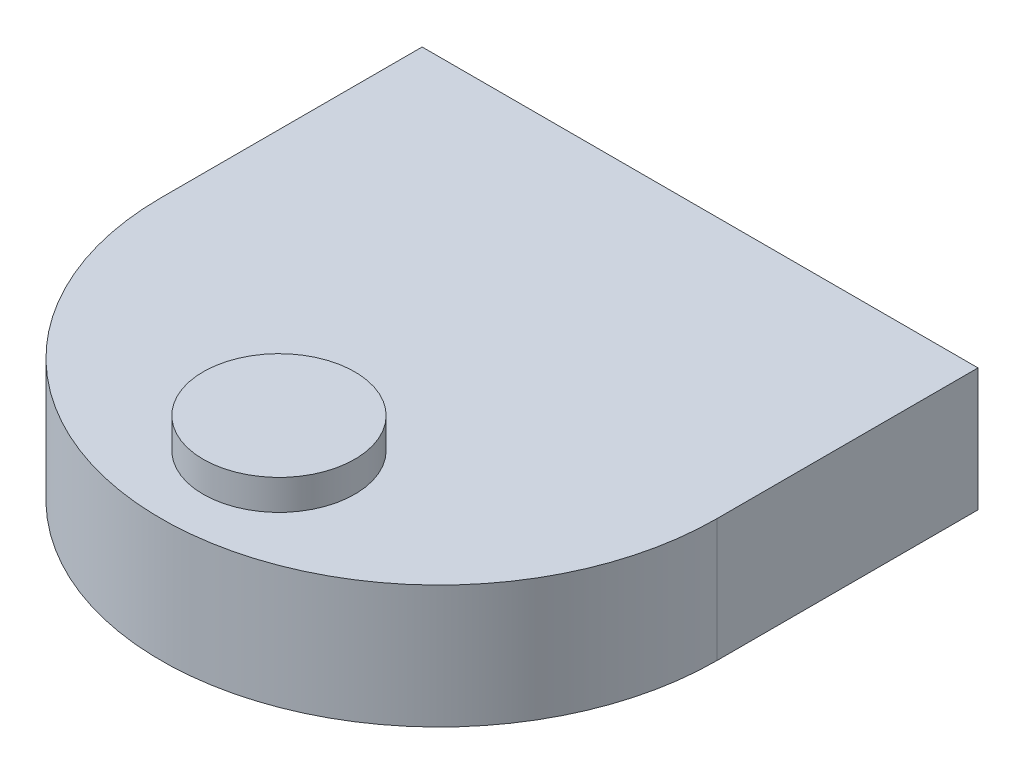
ISO-10303-21;
HEADER;
FILE_DESCRIPTION(('STEP AP214'),'2;1');
FILE_NAME('part.step','',(''),(''),'','','');
FILE_SCHEMA(('AUTOMOTIVE_DESIGN { 1 0 10303 214 1 1 1 1 }'));
ENDSEC;
DATA;
#1=APPLICATION_CONTEXT('core data for automotive mechanical design processes');
#2=APPLICATION_PROTOCOL_DEFINITION('international standard','automotive_design',2000,#1);
#3=PRODUCT_CONTEXT('',#1,'mechanical');
#4=PRODUCT('Part','Part','',(#3));
#5=PRODUCT_RELATED_PRODUCT_CATEGORY('part','',(#4));
#6=PRODUCT_DEFINITION_FORMATION('','',#4);
#7=PRODUCT_DEFINITION_CONTEXT('part definition',#1,'design');
#8=PRODUCT_DEFINITION('design','',#6,#7);
#9=PRODUCT_DEFINITION_SHAPE('','',#8);
#10=(LENGTH_UNIT() NAMED_UNIT(*) SI_UNIT(.MILLI.,.METRE.));
#11=(NAMED_UNIT(*) PLANE_ANGLE_UNIT() SI_UNIT($,.RADIAN.));
#12=(NAMED_UNIT(*) SI_UNIT($,.STERADIAN.) SOLID_ANGLE_UNIT());
#13=UNCERTAINTY_MEASURE_WITH_UNIT(LENGTH_MEASURE(1.E-05),#10,'distance_accuracy_value','');
#14=(GEOMETRIC_REPRESENTATION_CONTEXT(3) GLOBAL_UNCERTAINTY_ASSIGNED_CONTEXT((#13)) GLOBAL_UNIT_ASSIGNED_CONTEXT((#10,
#11,#12)) REPRESENTATION_CONTEXT('',''));
#15=CARTESIAN_POINT('',(0.,0.,0.));
#16=DIRECTION('',(0.,0.,1.));
#17=DIRECTION('',(1.,0.,0.));
#18=AXIS2_PLACEMENT_3D('',#15,#16,#17);
#19=CARTESIAN_POINT('',(0.,73.,0.));
#20=DIRECTION('',(0.,-1.,0.));
#21=DIRECTION('',(0.,0.,-1.));
#22=AXIS2_PLACEMENT_3D('',#19,#20,#21);
#23=CYLINDRICAL_SURFACE('',#22,165.);
#24=CARTESIAN_POINT('',(0.,0.,0.));
#25=DIRECTION('',(0.,1.,0.));
#26=DIRECTION('',(0.,0.,1.));
#27=AXIS2_PLACEMENT_3D('',#24,#25,#26);
#28=CIRCLE('',#27,165.);
#29=CARTESIAN_POINT('',(-165.,0.,0.));
#30=VERTEX_POINT('',#29);
#31=CARTESIAN_POINT('',(165.,0.,0.));
#32=VERTEX_POINT('',#31);
#33=EDGE_CURVE('E194',#30,#32,#28,.T.);
#34=ORIENTED_EDGE('',*,*,#33,.T.);
#35=DIRECTION('',(0.,-1.,0.));
#36=VECTOR('',#35,1.);
#37=CARTESIAN_POINT('',(165.,73.,0.));
#38=LINE('',#37,#36);
#39=CARTESIAN_POINT('',(165.,73.,0.));
#40=VERTEX_POINT('',#39);
#41=EDGE_CURVE('E11',#40,#32,#38,.T.);
#42=ORIENTED_EDGE('',*,*,#41,.F.);
#43=CARTESIAN_POINT('',(0.,73.,0.));
#44=DIRECTION('',(0.,1.,0.));
#45=DIRECTION('',(0.,0.,1.));
#46=AXIS2_PLACEMENT_3D('',#43,#44,#45);
#47=CIRCLE('',#46,165.);
#48=CARTESIAN_POINT('',(-165.,73.,0.));
#49=VERTEX_POINT('',#48);
#50=EDGE_CURVE('E198',#49,#40,#47,.T.);
#51=ORIENTED_EDGE('',*,*,#50,.F.);
#52=DIRECTION('',(0.,-1.,0.));
#53=VECTOR('',#52,1.);
#54=CARTESIAN_POINT('',(-165.,73.,0.));
#55=LINE('',#54,#53);
#56=EDGE_CURVE('E210',#49,#30,#55,.T.);
#57=ORIENTED_EDGE('',*,*,#56,.T.);
#58=EDGE_LOOP('',(#34,#42,#51,#57));
#59=FACE_BOUND('',#58,.T.);
#60=ADVANCED_FACE('F36',(#59),#23,.T.);
#61=CARTESIAN_POINT('',(165.,73.,0.));
#62=DIRECTION('',(1.,0.,0.));
#63=DIRECTION('',(0.,0.,-1.));
#64=AXIS2_PLACEMENT_3D('',#61,#62,#63);
#65=PLANE('',#64);
#66=DIRECTION('',(0.,0.,1.));
#67=VECTOR('',#66,1.);
#68=CARTESIAN_POINT('',(165.,0.,0.));
#69=LINE('',#68,#67);
#70=CARTESIAN_POINT('',(165.,0.,-155.));
#71=VERTEX_POINT('',#70);
#72=EDGE_CURVE('E213',#71,#32,#69,.T.);
#73=ORIENTED_EDGE('',*,*,#72,.F.);
#74=DIRECTION('',(0.,-1.,0.));
#75=VECTOR('',#74,1.);
#76=CARTESIAN_POINT('',(165.,73.,-155.));
#77=LINE('',#76,#75);
#78=CARTESIAN_POINT('',(165.,73.,-155.));
#79=VERTEX_POINT('',#78);
#80=EDGE_CURVE('E44',#79,#71,#77,.T.);
#81=ORIENTED_EDGE('',*,*,#80,.F.);
#82=DIRECTION('',(0.,0.,1.));
#83=VECTOR('',#82,1.);
#84=CARTESIAN_POINT('',(165.,73.,0.));
#85=LINE('',#84,#83);
#86=EDGE_CURVE('E200',#79,#40,#85,.T.);
#87=ORIENTED_EDGE('',*,*,#86,.T.);
#88=ORIENTED_EDGE('',*,*,#41,.T.);
#89=EDGE_LOOP('',(#73,#81,#87,#88));
#90=FACE_BOUND('',#89,.T.);
#91=ADVANCED_FACE('F248',(#90),#65,.T.);
#92=CARTESIAN_POINT('',(0.,73.,-155.));
#93=DIRECTION('',(0.,0.,-1.));
#94=DIRECTION('',(-1.,0.,0.));
#95=AXIS2_PLACEMENT_3D('',#92,#93,#94);
#96=PLANE('',#95);
#97=DIRECTION('',(1.,0.,0.));
#98=VECTOR('',#97,1.);
#99=CARTESIAN_POINT('',(0.,0.,-155.));
#100=LINE('',#99,#98);
#101=CARTESIAN_POINT('',(-165.,0.,-155.));
#102=VERTEX_POINT('',#101);
#103=EDGE_CURVE('E216',#102,#71,#100,.T.);
#104=ORIENTED_EDGE('',*,*,#103,.F.);
#105=DIRECTION('',(0.,-1.,0.));
#106=VECTOR('',#105,1.);
#107=CARTESIAN_POINT('',(-165.,73.,-155.));
#108=LINE('',#107,#106);
#109=CARTESIAN_POINT('',(-165.,73.,-155.));
#110=VERTEX_POINT('',#109);
#111=EDGE_CURVE('E222',#110,#102,#108,.T.);
#112=ORIENTED_EDGE('',*,*,#111,.F.);
#113=DIRECTION('',(1.,0.,0.));
#114=VECTOR('',#113,1.);
#115=CARTESIAN_POINT('',(0.,73.,-155.));
#116=LINE('',#115,#114);
#117=EDGE_CURVE('E204',#110,#79,#116,.T.);
#118=ORIENTED_EDGE('',*,*,#117,.T.);
#119=ORIENTED_EDGE('',*,*,#80,.T.);
#120=EDGE_LOOP('',(#104,#112,#118,#119));
#121=FACE_BOUND('',#120,.T.);
#122=ADVANCED_FACE('F253',(#121),#96,.T.);
#123=CARTESIAN_POINT('',(-165.,73.,0.));
#124=DIRECTION('',(-1.,0.,0.));
#125=DIRECTION('',(0.,0.,1.));
#126=AXIS2_PLACEMENT_3D('',#123,#124,#125);
#127=PLANE('',#126);
#128=DIRECTION('',(0.,0.,-1.));
#129=VECTOR('',#128,1.);
#130=CARTESIAN_POINT('',(-165.,0.,0.));
#131=LINE('',#130,#129);
#132=EDGE_CURVE('E201',#30,#102,#131,.T.);
#133=ORIENTED_EDGE('',*,*,#132,.F.);
#134=ORIENTED_EDGE('',*,*,#56,.F.);
#135=DIRECTION('',(0.,0.,-1.));
#136=VECTOR('',#135,1.);
#137=CARTESIAN_POINT('',(-165.,73.,0.));
#138=LINE('',#137,#136);
#139=EDGE_CURVE('E207',#49,#110,#138,.T.);
#140=ORIENTED_EDGE('',*,*,#139,.T.);
#141=ORIENTED_EDGE('',*,*,#111,.T.);
#142=EDGE_LOOP('',(#133,#134,#140,#141));
#143=FACE_BOUND('',#142,.T.);
#144=ADVANCED_FACE('F269',(#143),#127,.T.);
#145=CARTESIAN_POINT('',(0.,73.,0.));
#146=DIRECTION('',(0.,1.,0.));
#147=DIRECTION('',(0.,0.,1.));
#148=AXIS2_PLACEMENT_3D('',#145,#146,#147);
#149=PLANE('',#148);
#150=CARTESIAN_POINT('',(0.,73.,95.));
#151=DIRECTION('',(0.,1.,0.));
#152=DIRECTION('',(0.,0.,1.));
#153=AXIS2_PLACEMENT_3D('',#150,#151,#152);
#154=CIRCLE('',#153,45.);
#155=CARTESIAN_POINT('',(0.,73.,140.));
#156=VERTEX_POINT('',#155);
#157=EDGE_CURVE('E195',#156,#156,#154,.T.);
#158=ORIENTED_EDGE('',*,*,#157,.F.);
#159=EDGE_LOOP('',(#158));
#160=FACE_BOUND('',#159,.T.);
#161=ORIENTED_EDGE('',*,*,#50,.T.);
#162=ORIENTED_EDGE('',*,*,#86,.F.);
#163=ORIENTED_EDGE('',*,*,#117,.F.);
#164=ORIENTED_EDGE('',*,*,#139,.F.);
#165=EDGE_LOOP('',(#161,#162,#163,#164));
#166=FACE_BOUND('',#165,.T.);
#167=ADVANCED_FACE('F265',(#160,#166),#149,.T.);
#168=CARTESIAN_POINT('',(0.,0.,0.));
#169=DIRECTION('',(0.,1.,0.));
#170=DIRECTION('',(0.,0.,1.));
#171=AXIS2_PLACEMENT_3D('',#168,#169,#170);
#172=PLANE('',#171);
#173=CARTESIAN_POINT('',(90.,0.,-100.));
#174=DIRECTION('',(0.,1.,0.));
#175=DIRECTION('',(0.,0.,1.));
#176=AXIS2_PLACEMENT_3D('',#173,#174,#175);
#177=CIRCLE('',#176,9.99999999999999);
#178=CARTESIAN_POINT('',(90.,0.,-90.));
#179=VERTEX_POINT('',#178);
#180=EDGE_CURVE('E39',#179,#179,#177,.T.);
#181=ORIENTED_EDGE('',*,*,#180,.T.);
#182=EDGE_LOOP('',(#181));
#183=FACE_BOUND('',#182,.T.);
#184=CARTESIAN_POINT('',(90.,0.,100.));
#185=DIRECTION('',(0.,1.,0.));
#186=DIRECTION('',(0.,0.,1.));
#187=AXIS2_PLACEMENT_3D('',#184,#185,#186);
#188=CIRCLE('',#187,9.99999999999999);
#189=CARTESIAN_POINT('',(90.,0.,110.));
#190=VERTEX_POINT('',#189);
#191=EDGE_CURVE('E228',#190,#190,#188,.T.);
#192=ORIENTED_EDGE('',*,*,#191,.T.);
#193=EDGE_LOOP('',(#192));
#194=FACE_BOUND('',#193,.T.);
#195=CARTESIAN_POINT('',(-90.,0.,-100.));
#196=DIRECTION('',(0.,1.,0.));
#197=DIRECTION('',(0.,0.,1.));
#198=AXIS2_PLACEMENT_3D('',#195,#196,#197);
#199=CIRCLE('',#198,9.99999999999999);
#200=CARTESIAN_POINT('',(-90.,0.,-90.));
#201=VERTEX_POINT('',#200);
#202=EDGE_CURVE('E137',#201,#201,#199,.T.);
#203=ORIENTED_EDGE('',*,*,#202,.T.);
#204=EDGE_LOOP('',(#203));
#205=FACE_BOUND('',#204,.T.);
#206=DIRECTION('',(-1.,0.,0.));
#207=VECTOR('',#206,1.);
#208=CARTESIAN_POINT('',(107.5,0.,40.));
#209=LINE('',#208,#207);
#210=CARTESIAN_POINT('',(127.5,0.,40.));
#211=VERTEX_POINT('',#210);
#212=CARTESIAN_POINT('',(107.5,0.,40.));
#213=VERTEX_POINT('',#212);
#214=EDGE_CURVE('E160',#211,#213,#209,.T.);
#215=ORIENTED_EDGE('',*,*,#214,.F.);
#216=DIRECTION('',(0.,0.,1.));
#217=VECTOR('',#216,1.);
#218=CARTESIAN_POINT('',(127.5,0.,-40.));
#219=LINE('',#218,#217);
#220=CARTESIAN_POINT('',(127.5,0.,-40.));
#221=VERTEX_POINT('',#220);
#222=EDGE_CURVE('E52',#221,#211,#219,.T.);
#223=ORIENTED_EDGE('',*,*,#222,.F.);
#224=DIRECTION('',(1.,0.,0.));
#225=VECTOR('',#224,1.);
#226=CARTESIAN_POINT('',(107.5,0.,-40.));
#227=LINE('',#226,#225);
#228=CARTESIAN_POINT('',(107.5,0.,-40.));
#229=VERTEX_POINT('',#228);
#230=EDGE_CURVE('E155',#229,#221,#227,.T.);
#231=ORIENTED_EDGE('',*,*,#230,.F.);
#232=DIRECTION('',(0.,0.,-1.));
#233=VECTOR('',#232,1.);
#234=CARTESIAN_POINT('',(107.5,0.,-40.));
#235=LINE('',#234,#233);
#236=EDGE_CURVE('E143',#213,#229,#235,.T.);
#237=ORIENTED_EDGE('',*,*,#236,.F.);
#238=EDGE_LOOP('',(#215,#223,#231,#237));
#239=FACE_BOUND('',#238,.T.);
#240=DIRECTION('',(-1.,0.,0.));
#241=VECTOR('',#240,1.);
#242=CARTESIAN_POINT('',(-127.5,0.,40.));
#243=LINE('',#242,#241);
#244=CARTESIAN_POINT('',(-107.5,0.,40.));
#245=VERTEX_POINT('',#244);
#246=CARTESIAN_POINT('',(-127.5,0.,40.));
#247=VERTEX_POINT('',#246);
#248=EDGE_CURVE('E175',#245,#247,#243,.T.);
#249=ORIENTED_EDGE('',*,*,#248,.F.);
#250=DIRECTION('',(0.,0.,1.));
#251=VECTOR('',#250,1.);
#252=CARTESIAN_POINT('',(-107.5,0.,-40.));
#253=LINE('',#252,#251);
#254=CARTESIAN_POINT('',(-107.5,0.,-40.));
#255=VERTEX_POINT('',#254);
#256=EDGE_CURVE('E60',#255,#245,#253,.T.);
#257=ORIENTED_EDGE('',*,*,#256,.F.);
#258=DIRECTION('',(1.,0.,0.));
#259=VECTOR('',#258,1.);
#260=CARTESIAN_POINT('',(-127.5,0.,-40.));
#261=LINE('',#260,#259);
#262=CARTESIAN_POINT('',(-127.5,0.,-40.));
#263=VERTEX_POINT('',#262);
#264=EDGE_CURVE('E171',#263,#255,#261,.T.);
#265=ORIENTED_EDGE('',*,*,#264,.F.);
#266=DIRECTION('',(0.,0.,-1.));
#267=VECTOR('',#266,1.);
#268=CARTESIAN_POINT('',(-127.5,0.,-40.));
#269=LINE('',#268,#267);
#270=EDGE_CURVE('E178',#247,#263,#269,.T.);
#271=ORIENTED_EDGE('',*,*,#270,.F.);
#272=EDGE_LOOP('',(#249,#257,#265,#271));
#273=FACE_BOUND('',#272,.T.);
#274=CARTESIAN_POINT('',(-90.,0.,100.));
#275=DIRECTION('',(0.,1.,0.));
#276=DIRECTION('',(0.,0.,1.));
#277=AXIS2_PLACEMENT_3D('',#274,#275,#276);
#278=CIRCLE('',#277,9.99999999999999);
#279=CARTESIAN_POINT('',(-90.,0.,110.));
#280=VERTEX_POINT('',#279);
#281=EDGE_CURVE('E184',#280,#280,#278,.T.);
#282=ORIENTED_EDGE('',*,*,#281,.T.);
#283=EDGE_LOOP('',(#282));
#284=FACE_BOUND('',#283,.T.);
#285=ORIENTED_EDGE('',*,*,#33,.F.);
#286=ORIENTED_EDGE('',*,*,#132,.T.);
#287=ORIENTED_EDGE('',*,*,#103,.T.);
#288=ORIENTED_EDGE('',*,*,#72,.T.);
#289=EDGE_LOOP('',(#285,#286,#287,#288));
#290=FACE_BOUND('',#289,.T.);
#291=ADVANCED_FACE('F235',(#183,#194,#205,#239,#273,#284,#290),#172,.F.);
#292=CARTESIAN_POINT('',(0.,91.,95.));
#293=DIRECTION('',(0.,-1.,0.));
#294=DIRECTION('',(0.,0.,-1.));
#295=AXIS2_PLACEMENT_3D('',#292,#293,#294);
#296=CYLINDRICAL_SURFACE('',#295,45.);
#297=CARTESIAN_POINT('',(0.,91.,95.));
#298=DIRECTION('',(0.,1.,0.));
#299=DIRECTION('',(0.,0.,1.));
#300=AXIS2_PLACEMENT_3D('',#297,#298,#299);
#301=CIRCLE('',#300,45.);
#302=CARTESIAN_POINT('',(0.,91.,140.));
#303=VERTEX_POINT('',#302);
#304=EDGE_CURVE('E191',#303,#303,#301,.T.);
#305=ORIENTED_EDGE('',*,*,#304,.F.);
#306=EDGE_LOOP('',(#305));
#307=FACE_BOUND('',#306,.T.);
#308=ORIENTED_EDGE('',*,*,#157,.T.);
#309=EDGE_LOOP('',(#308));
#310=FACE_BOUND('',#309,.T.);
#311=ADVANCED_FACE('F281',(#307,#310),#296,.T.);
#312=CARTESIAN_POINT('',(0.,91.,95.));
#313=DIRECTION('',(0.,1.,0.));
#314=DIRECTION('',(0.,0.,1.));
#315=AXIS2_PLACEMENT_3D('',#312,#313,#314);
#316=PLANE('',#315);
#317=ORIENTED_EDGE('',*,*,#304,.T.);
#318=EDGE_LOOP('',(#317));
#319=FACE_BOUND('',#318,.T.);
#320=ADVANCED_FACE('F285',(#319),#316,.T.);
#321=CARTESIAN_POINT('',(-90.,0.,100.));
#322=DIRECTION('',(1.,0.,0.));
#323=DIRECTION('',(0.,0.,-1.));
#324=AXIS2_PLACEMENT_3D('',#321,#322,#323);
#325=SPHERICAL_SURFACE('',#324,9.99999999999999);
#326=CARTESIAN_POINT('',(-90.,0.,100.));
#327=DIRECTION('',(0.,1.,0.));
#328=DIRECTION('',(0.,0.,1.));
#329=AXIS2_PLACEMENT_3D('',#326,#327,#328);
#330=SPHERICAL_SURFACE('',#329,9.99999999999999);
#331=ORIENTED_EDGE('',*,*,#281,.F.);
#332=EDGE_LOOP('',(#331));
#333=FACE_BOUND('',#332,.T.);
#334=ADVANCED_FACE('F289',(#333),#330,.T.);
#335=CARTESIAN_POINT('',(-107.5,27.5,-40.));
#336=DIRECTION('',(1.,0.,0.));
#337=DIRECTION('',(0.,0.,-1.));
#338=AXIS2_PLACEMENT_3D('',#335,#336,#337);
#339=PLANE('',#338);
#340=DIRECTION('',(0.,-1.,0.));
#341=VECTOR('',#340,1.);
#342=CARTESIAN_POINT('',(-107.5,27.5,40.));
#343=LINE('',#342,#341);
#344=CARTESIAN_POINT('',(-107.5,27.5,40.));
#345=VERTEX_POINT('',#344);
#346=EDGE_CURVE('E173',#345,#245,#343,.T.);
#347=ORIENTED_EDGE('',*,*,#346,.F.);
#348=CARTESIAN_POINT('',(-107.5,27.5,0.));
#349=DIRECTION('',(-1.,0.,0.));
#350=DIRECTION('',(0.,0.,1.));
#351=AXIS2_PLACEMENT_3D('',#348,#349,#350);
#352=CIRCLE('',#351,40.);
#353=CARTESIAN_POINT('',(-107.5,27.5,-40.));
#354=VERTEX_POINT('',#353);
#355=EDGE_CURVE('E161',#345,#354,#352,.T.);
#356=ORIENTED_EDGE('',*,*,#355,.T.);
#357=DIRECTION('',(0.,-1.,0.));
#358=VECTOR('',#357,1.);
#359=CARTESIAN_POINT('',(-107.5,27.5,-40.));
#360=LINE('',#359,#358);
#361=EDGE_CURVE('E182',#354,#255,#360,.T.);
#362=ORIENTED_EDGE('',*,*,#361,.T.);
#363=ORIENTED_EDGE('',*,*,#256,.T.);
#364=EDGE_LOOP('',(#347,#356,#362,#363));
#365=FACE_BOUND('',#364,.T.);
#366=ADVANCED_FACE('F293',(#365),#339,.F.);
#367=CARTESIAN_POINT('',(-127.5,27.5,-40.));
#368=DIRECTION('',(0.,0.,-1.));
#369=DIRECTION('',(-1.,0.,0.));
#370=AXIS2_PLACEMENT_3D('',#367,#368,#369);
#371=PLANE('',#370);
#372=ORIENTED_EDGE('',*,*,#264,.T.);
#373=ORIENTED_EDGE('',*,*,#361,.F.);
#374=DIRECTION('',(1.,0.,0.));
#375=VECTOR('',#374,1.);
#376=CARTESIAN_POINT('',(-127.5,27.5,-40.));
#377=LINE('',#376,#375);
#378=CARTESIAN_POINT('',(-127.5,27.5,-40.));
#379=VERTEX_POINT('',#378);
#380=EDGE_CURVE('E170',#379,#354,#377,.T.);
#381=ORIENTED_EDGE('',*,*,#380,.F.);
#382=DIRECTION('',(0.,-1.,0.));
#383=VECTOR('',#382,1.);
#384=CARTESIAN_POINT('',(-127.5,27.5,-40.));
#385=LINE('',#384,#383);
#386=EDGE_CURVE('E185',#379,#263,#385,.T.);
#387=ORIENTED_EDGE('',*,*,#386,.T.);
#388=EDGE_LOOP('',(#372,#373,#381,#387));
#389=FACE_BOUND('',#388,.T.);
#390=ADVANCED_FACE('F297',(#389),#371,.F.);
#391=CARTESIAN_POINT('',(-127.5,27.5,-40.));
#392=DIRECTION('',(-1.,0.,0.));
#393=DIRECTION('',(0.,0.,1.));
#394=AXIS2_PLACEMENT_3D('',#391,#392,#393);
#395=PLANE('',#394);
#396=ORIENTED_EDGE('',*,*,#386,.F.);
#397=CARTESIAN_POINT('',(-127.5,27.5,0.));
#398=DIRECTION('',(-1.,0.,0.));
#399=DIRECTION('',(0.,0.,1.));
#400=AXIS2_PLACEMENT_3D('',#397,#398,#399);
#401=CIRCLE('',#400,40.);
#402=CARTESIAN_POINT('',(-127.5,27.5,40.));
#403=VERTEX_POINT('',#402);
#404=EDGE_CURVE('E344',#403,#379,#401,.T.);
#405=ORIENTED_EDGE('',*,*,#404,.F.);
#406=DIRECTION('',(0.,-1.,0.));
#407=VECTOR('',#406,1.);
#408=CARTESIAN_POINT('',(-127.5,27.5,40.));
#409=LINE('',#408,#407);
#410=EDGE_CURVE('E188',#403,#247,#409,.T.);
#411=ORIENTED_EDGE('',*,*,#410,.T.);
#412=ORIENTED_EDGE('',*,*,#270,.T.);
#413=EDGE_LOOP('',(#396,#405,#411,#412));
#414=FACE_BOUND('',#413,.T.);
#415=ADVANCED_FACE('F302',(#414),#395,.F.);
#416=CARTESIAN_POINT('',(-127.5,27.5,40.));
#417=DIRECTION('',(0.,0.,1.));
#418=DIRECTION('',(1.,0.,0.));
#419=AXIS2_PLACEMENT_3D('',#416,#417,#418);
#420=PLANE('',#419);
#421=ORIENTED_EDGE('',*,*,#248,.T.);
#422=ORIENTED_EDGE('',*,*,#410,.F.);
#423=DIRECTION('',(-1.,0.,0.));
#424=VECTOR('',#423,1.);
#425=CARTESIAN_POINT('',(-127.5,27.5,40.));
#426=LINE('',#425,#424);
#427=EDGE_CURVE('E168',#345,#403,#426,.T.);
#428=ORIENTED_EDGE('',*,*,#427,.F.);
#429=ORIENTED_EDGE('',*,*,#346,.T.);
#430=EDGE_LOOP('',(#421,#422,#428,#429));
#431=FACE_BOUND('',#430,.T.);
#432=ADVANCED_FACE('F298',(#431),#420,.F.);
#433=CARTESIAN_POINT('',(127.5,27.5,-40.));
#434=DIRECTION('',(1.,0.,0.));
#435=DIRECTION('',(0.,0.,-1.));
#436=AXIS2_PLACEMENT_3D('',#433,#434,#435);
#437=PLANE('',#436);
#438=ORIENTED_EDGE('',*,*,#222,.T.);
#439=DIRECTION('',(0.,-1.,0.));
#440=VECTOR('',#439,1.);
#441=CARTESIAN_POINT('',(127.5,27.5,40.));
#442=LINE('',#441,#440);
#443=CARTESIAN_POINT('',(127.5,27.5,40.));
#444=VERTEX_POINT('',#443);
#445=EDGE_CURVE('E152',#444,#211,#442,.T.);
#446=ORIENTED_EDGE('',*,*,#445,.F.);
#447=CARTESIAN_POINT('',(127.5,27.5,0.));
#448=DIRECTION('',(-1.,0.,0.));
#449=DIRECTION('',(0.,0.,1.));
#450=AXIS2_PLACEMENT_3D('',#447,#448,#449);
#451=CIRCLE('',#450,40.);
#452=CARTESIAN_POINT('',(127.5,27.5,-40.));
#453=VERTEX_POINT('',#452);
#454=EDGE_CURVE('E136',#444,#453,#451,.T.);
#455=ORIENTED_EDGE('',*,*,#454,.T.);
#456=DIRECTION('',(0.,-1.,0.));
#457=VECTOR('',#456,1.);
#458=CARTESIAN_POINT('',(127.5,27.5,-40.));
#459=LINE('',#458,#457);
#460=EDGE_CURVE('E147',#453,#221,#459,.T.);
#461=ORIENTED_EDGE('',*,*,#460,.T.);
#462=EDGE_LOOP('',(#438,#446,#455,#461));
#463=FACE_BOUND('',#462,.T.);
#464=ADVANCED_FACE('F301',(#463),#437,.F.);
#465=CARTESIAN_POINT('',(107.5,27.5,-40.));
#466=DIRECTION('',(0.,0.,-1.));
#467=DIRECTION('',(-1.,0.,0.));
#468=AXIS2_PLACEMENT_3D('',#465,#466,#467);
#469=PLANE('',#468);
#470=ORIENTED_EDGE('',*,*,#230,.T.);
#471=ORIENTED_EDGE('',*,*,#460,.F.);
#472=DIRECTION('',(1.,0.,0.));
#473=VECTOR('',#472,1.);
#474=CARTESIAN_POINT('',(107.5,27.5,-40.));
#475=LINE('',#474,#473);
#476=CARTESIAN_POINT('',(107.5,27.5,-40.));
#477=VERTEX_POINT('',#476);
#478=EDGE_CURVE('E130',#477,#453,#475,.T.);
#479=ORIENTED_EDGE('',*,*,#478,.F.);
#480=DIRECTION('',(0.,-1.,0.));
#481=VECTOR('',#480,1.);
#482=CARTESIAN_POINT('',(107.5,27.5,-40.));
#483=LINE('',#482,#481);
#484=EDGE_CURVE('E140',#477,#229,#483,.T.);
#485=ORIENTED_EDGE('',*,*,#484,.T.);
#486=EDGE_LOOP('',(#470,#471,#479,#485));
#487=FACE_BOUND('',#486,.T.);
#488=ADVANCED_FACE('F151',(#487),#469,.F.);
#489=CARTESIAN_POINT('',(107.5,27.5,-40.));
#490=DIRECTION('',(-1.,0.,0.));
#491=DIRECTION('',(0.,0.,1.));
#492=AXIS2_PLACEMENT_3D('',#489,#490,#491);
#493=PLANE('',#492);
#494=ORIENTED_EDGE('',*,*,#236,.T.);
#495=ORIENTED_EDGE('',*,*,#484,.F.);
#496=CARTESIAN_POINT('',(107.5,27.5,0.));
#497=DIRECTION('',(-1.,0.,0.));
#498=DIRECTION('',(0.,0.,1.));
#499=AXIS2_PLACEMENT_3D('',#496,#497,#498);
#500=CIRCLE('',#499,40.);
#501=CARTESIAN_POINT('',(107.5,27.5,40.));
#502=VERTEX_POINT('',#501);
#503=EDGE_CURVE('E126',#502,#477,#500,.T.);
#504=ORIENTED_EDGE('',*,*,#503,.F.);
#505=DIRECTION('',(0.,-1.,0.));
#506=VECTOR('',#505,1.);
#507=CARTESIAN_POINT('',(107.5,27.5,40.));
#508=LINE('',#507,#506);
#509=EDGE_CURVE('E148',#502,#213,#508,.T.);
#510=ORIENTED_EDGE('',*,*,#509,.T.);
#511=EDGE_LOOP('',(#494,#495,#504,#510));
#512=FACE_BOUND('',#511,.T.);
#513=ADVANCED_FACE('F141',(#512),#493,.F.);
#514=CARTESIAN_POINT('',(107.5,27.5,40.));
#515=DIRECTION('',(0.,0.,1.));
#516=DIRECTION('',(1.,0.,0.));
#517=AXIS2_PLACEMENT_3D('',#514,#515,#516);
#518=PLANE('',#517);
#519=ORIENTED_EDGE('',*,*,#214,.T.);
#520=ORIENTED_EDGE('',*,*,#509,.F.);
#521=DIRECTION('',(-1.,0.,0.));
#522=VECTOR('',#521,1.);
#523=CARTESIAN_POINT('',(107.5,27.5,40.));
#524=LINE('',#523,#522);
#525=EDGE_CURVE('E133',#444,#502,#524,.T.);
#526=ORIENTED_EDGE('',*,*,#525,.F.);
#527=ORIENTED_EDGE('',*,*,#445,.T.);
#528=EDGE_LOOP('',(#519,#520,#526,#527));
#529=FACE_BOUND('',#528,.T.);
#530=ADVANCED_FACE('F312',(#529),#518,.F.);
#531=CARTESIAN_POINT('',(-127.5,27.5,0.));
#532=DIRECTION('',(-1.,0.,0.));
#533=DIRECTION('',(0.,0.,1.));
#534=AXIS2_PLACEMENT_3D('',#531,#532,#533);
#535=CYLINDRICAL_SURFACE('',#534,40.);
#536=ORIENTED_EDGE('',*,*,#380,.T.);
#537=ORIENTED_EDGE('',*,*,#355,.F.);
#538=ORIENTED_EDGE('',*,*,#427,.T.);
#539=ORIENTED_EDGE('',*,*,#404,.T.);
#540=EDGE_LOOP('',(#536,#537,#538,#539));
#541=FACE_BOUND('',#540,.T.);
#542=ADVANCED_FACE('F315',(#541),#535,.F.);
#543=CARTESIAN_POINT('',(-127.5,27.5,0.));
#544=DIRECTION('',(-1.,0.,0.));
#545=DIRECTION('',(0.,0.,1.));
#546=AXIS2_PLACEMENT_3D('',#543,#544,#545);
#547=CYLINDRICAL_SURFACE('',#546,40.);
#548=ORIENTED_EDGE('',*,*,#454,.F.);
#549=ORIENTED_EDGE('',*,*,#525,.T.);
#550=ORIENTED_EDGE('',*,*,#503,.T.);
#551=ORIENTED_EDGE('',*,*,#478,.T.);
#552=EDGE_LOOP('',(#548,#549,#550,#551));
#553=FACE_BOUND('',#552,.T.);
#554=ADVANCED_FACE('F128',(#553),#547,.F.);
#555=CARTESIAN_POINT('',(-90.,0.,-100.));
#556=DIRECTION('',(1.,0.,0.));
#557=DIRECTION('',(0.,0.,-1.));
#558=AXIS2_PLACEMENT_3D('',#555,#556,#557);
#559=SPHERICAL_SURFACE('',#558,9.99999999999999);
#560=CARTESIAN_POINT('',(-90.,0.,-100.));
#561=DIRECTION('',(0.,1.,0.));
#562=DIRECTION('',(0.,0.,1.));
#563=AXIS2_PLACEMENT_3D('',#560,#561,#562);
#564=SPHERICAL_SURFACE('',#563,9.99999999999999);
#565=ORIENTED_EDGE('',*,*,#202,.F.);
#566=EDGE_LOOP('',(#565));
#567=FACE_BOUND('',#566,.T.);
#568=ADVANCED_FACE('F244',(#567),#564,.T.);
#569=CARTESIAN_POINT('',(90.,0.,100.));
#570=DIRECTION('',(1.,0.,0.));
#571=DIRECTION('',(0.,0.,-1.));
#572=AXIS2_PLACEMENT_3D('',#569,#570,#571);
#573=SPHERICAL_SURFACE('',#572,9.99999999999999);
#574=CARTESIAN_POINT('',(90.,0.,100.));
#575=DIRECTION('',(0.,1.,0.));
#576=DIRECTION('',(0.,0.,1.));
#577=AXIS2_PLACEMENT_3D('',#574,#575,#576);
#578=SPHERICAL_SURFACE('',#577,9.99999999999999);
#579=ORIENTED_EDGE('',*,*,#191,.F.);
#580=EDGE_LOOP('',(#579));
#581=FACE_BOUND('',#580,.T.);
#582=ADVANCED_FACE('F239',(#581),#578,.T.);
#583=CARTESIAN_POINT('',(90.,0.,-100.));
#584=DIRECTION('',(1.,0.,0.));
#585=DIRECTION('',(0.,0.,-1.));
#586=AXIS2_PLACEMENT_3D('',#583,#584,#585);
#587=SPHERICAL_SURFACE('',#586,9.99999999999999);
#588=CARTESIAN_POINT('',(90.,0.,-100.));
#589=DIRECTION('',(0.,1.,0.));
#590=DIRECTION('',(0.,0.,1.));
#591=AXIS2_PLACEMENT_3D('',#588,#589,#590);
#592=SPHERICAL_SURFACE('',#591,9.99999999999999);
#593=ORIENTED_EDGE('',*,*,#180,.F.);
#594=EDGE_LOOP('',(#593));
#595=FACE_BOUND('',#594,.T.);
#596=ADVANCED_FACE('F237',(#595),#592,.T.);
#597=CLOSED_SHELL('',(#60,#91,#122,#144,#167,#291,#311,#320,#334,#366,#390,#415,#432,#464,#488,
#513,#530,#542,#554,#568,#582,#596));
#598=MANIFOLD_SOLID_BREP('B2',#597);
#599=ADVANCED_BREP_SHAPE_REPRESENTATION('',(#18,#598),#14);
#600=SHAPE_DEFINITION_REPRESENTATION(#9,#599);
ENDSEC;
END-ISO-10303-21;
